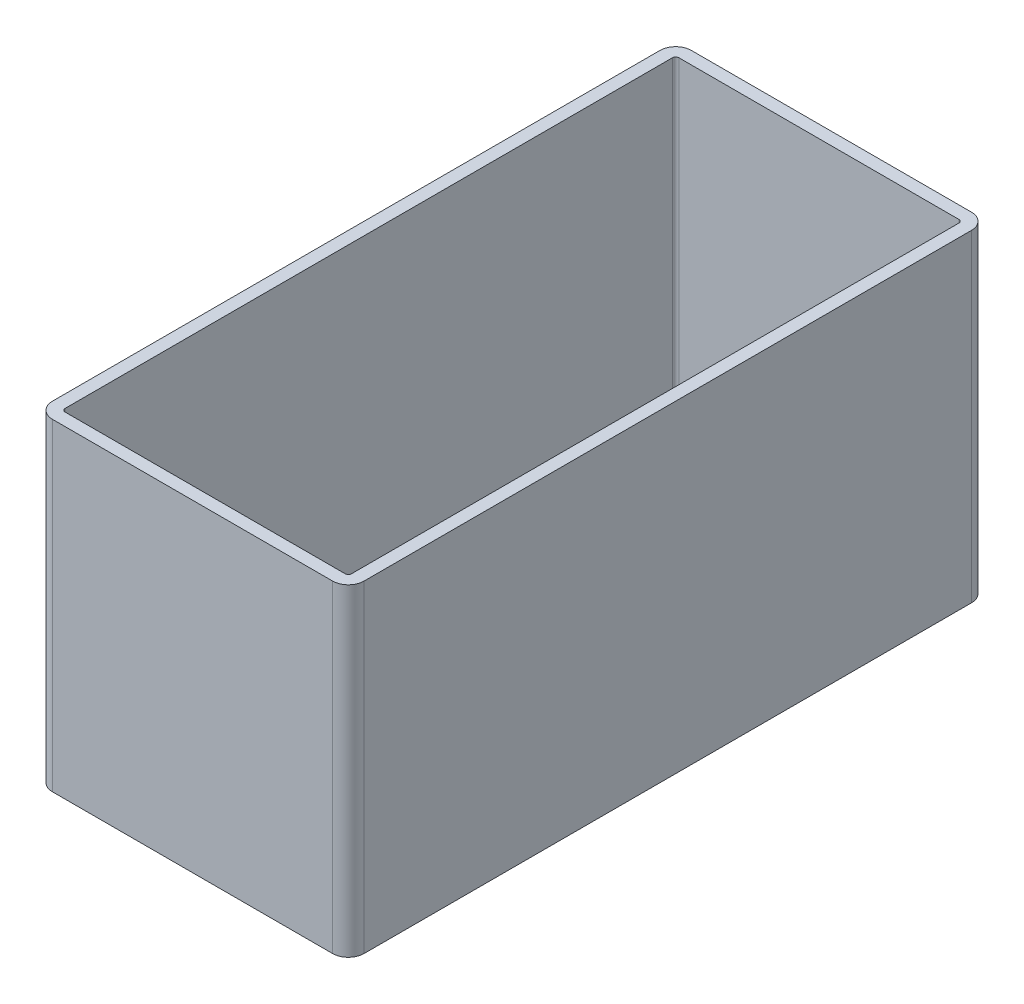
ISO-10303-21;
HEADER;
FILE_DESCRIPTION(('STEP AP214'),'2;1');
FILE_NAME('part.step','',(''),(''),'','','');
FILE_SCHEMA(('AUTOMOTIVE_DESIGN { 1 0 10303 214 1 1 1 1 }'));
ENDSEC;
DATA;
#1=APPLICATION_CONTEXT('core data for automotive mechanical design processes');
#2=APPLICATION_PROTOCOL_DEFINITION('international standard','automotive_design',2000,#1);
#3=PRODUCT_CONTEXT('',#1,'mechanical');
#4=PRODUCT('Part','Part','',(#3));
#5=PRODUCT_RELATED_PRODUCT_CATEGORY('part','',(#4));
#6=PRODUCT_DEFINITION_FORMATION('','',#4);
#7=PRODUCT_DEFINITION_CONTEXT('part definition',#1,'design');
#8=PRODUCT_DEFINITION('design','',#6,#7);
#9=PRODUCT_DEFINITION_SHAPE('','',#8);
#10=(LENGTH_UNIT() NAMED_UNIT(*) SI_UNIT(.MILLI.,.METRE.));
#11=(NAMED_UNIT(*) PLANE_ANGLE_UNIT() SI_UNIT($,.RADIAN.));
#12=(NAMED_UNIT(*) SI_UNIT($,.STERADIAN.) SOLID_ANGLE_UNIT());
#13=UNCERTAINTY_MEASURE_WITH_UNIT(LENGTH_MEASURE(1.E-05),#10,'distance_accuracy_value','');
#14=(GEOMETRIC_REPRESENTATION_CONTEXT(3) GLOBAL_UNCERTAINTY_ASSIGNED_CONTEXT((#13)) GLOBAL_UNIT_ASSIGNED_CONTEXT((#10,
#11,#12)) REPRESENTATION_CONTEXT('',''));
#15=CARTESIAN_POINT('',(0.,0.,0.));
#16=DIRECTION('',(0.,0.,1.));
#17=DIRECTION('',(1.,0.,0.));
#18=AXIS2_PLACEMENT_3D('',#15,#16,#17);
#19=CARTESIAN_POINT('',(9.9,10.25,-20.3));
#20=DIRECTION('',(-1.,0.,0.));
#21=DIRECTION('',(0.,0.,1.));
#22=AXIS2_PLACEMENT_3D('',#19,#20,#21);
#23=PLANE('',#22);
#24=DIRECTION('',(0.,0.,-1.));
#25=VECTOR('',#24,1.);
#26=CARTESIAN_POINT('',(9.9,-10.25,-20.3));
#27=LINE('',#26,#25);
#28=CARTESIAN_POINT('',(9.9,-10.25,19.3));
#29=VERTEX_POINT('',#28);
#30=CARTESIAN_POINT('',(9.9,-10.25,-19.3));
#31=VERTEX_POINT('',#30);
#32=EDGE_CURVE('E201',#29,#31,#27,.T.);
#33=ORIENTED_EDGE('',*,*,#32,.T.);
#34=DIRECTION('',(0.,-1.,0.));
#35=VECTOR('',#34,1.);
#36=CARTESIAN_POINT('',(9.9,10.25,-19.3));
#37=LINE('',#36,#35);
#38=CARTESIAN_POINT('',(9.9,10.25,-19.3));
#39=VERTEX_POINT('',#38);
#40=EDGE_CURVE('E265',#31,#39,#37,.F.);
#41=ORIENTED_EDGE('',*,*,#40,.T.);
#42=DIRECTION('',(0.,0.,-1.));
#43=VECTOR('',#42,1.);
#44=CARTESIAN_POINT('',(9.9,10.25,-20.3));
#45=LINE('',#44,#43);
#46=CARTESIAN_POINT('',(9.9,10.25,19.3));
#47=VERTEX_POINT('',#46);
#48=EDGE_CURVE('E213',#47,#39,#45,.T.);
#49=ORIENTED_EDGE('',*,*,#48,.F.);
#50=DIRECTION('',(0.,-1.,0.));
#51=VECTOR('',#50,1.);
#52=CARTESIAN_POINT('',(9.9,10.25,19.3));
#53=LINE('',#52,#51);
#54=EDGE_CURVE('E262',#47,#29,#53,.T.);
#55=ORIENTED_EDGE('',*,*,#54,.T.);
#56=EDGE_LOOP('',(#33,#41,#49,#55));
#57=FACE_BOUND('',#56,.T.);
#58=ADVANCED_FACE('F32',(#57),#23,.F.);
#59=CARTESIAN_POINT('',(-9.9,10.25,-20.3));
#60=DIRECTION('',(0.,0.,1.));
#61=DIRECTION('',(1.,0.,0.));
#62=AXIS2_PLACEMENT_3D('',#59,#60,#61);
#63=PLANE('',#62);
#64=DIRECTION('',(-1.,0.,0.));
#65=VECTOR('',#64,1.);
#66=CARTESIAN_POINT('',(-9.9,-10.25,-20.3));
#67=LINE('',#66,#65);
#68=CARTESIAN_POINT('',(8.89999999999999,-10.25,-20.3));
#69=VERTEX_POINT('',#68);
#70=CARTESIAN_POINT('',(-8.9,-10.25,-20.3));
#71=VERTEX_POINT('',#70);
#72=EDGE_CURVE('E229',#69,#71,#67,.T.);
#73=ORIENTED_EDGE('',*,*,#72,.T.);
#74=DIRECTION('',(0.,-1.,0.));
#75=VECTOR('',#74,1.);
#76=CARTESIAN_POINT('',(-8.9,10.25,-20.3));
#77=LINE('',#76,#75);
#78=CARTESIAN_POINT('',(-8.9,10.25,-20.3));
#79=VERTEX_POINT('',#78);
#80=EDGE_CURVE('E252',#71,#79,#77,.F.);
#81=ORIENTED_EDGE('',*,*,#80,.T.);
#82=DIRECTION('',(-1.,0.,0.));
#83=VECTOR('',#82,1.);
#84=CARTESIAN_POINT('',(-9.9,10.25,-20.3));
#85=LINE('',#84,#83);
#86=CARTESIAN_POINT('',(8.89999999999999,10.25,-20.3));
#87=VERTEX_POINT('',#86);
#88=EDGE_CURVE('E216',#87,#79,#85,.T.);
#89=ORIENTED_EDGE('',*,*,#88,.F.);
#90=DIRECTION('',(0.,-1.,0.));
#91=VECTOR('',#90,1.);
#92=CARTESIAN_POINT('',(8.9,10.25,-20.3));
#93=LINE('',#92,#91);
#94=EDGE_CURVE('E249',#87,#69,#93,.T.);
#95=ORIENTED_EDGE('',*,*,#94,.T.);
#96=EDGE_LOOP('',(#73,#81,#89,#95));
#97=FACE_BOUND('',#96,.T.);
#98=ADVANCED_FACE('F293',(#97),#63,.F.);
#99=CARTESIAN_POINT('',(-9.9,10.25,-20.3));
#100=DIRECTION('',(1.,0.,0.));
#101=DIRECTION('',(0.,0.,-1.));
#102=AXIS2_PLACEMENT_3D('',#99,#100,#101);
#103=PLANE('',#102);
#104=DIRECTION('',(0.,0.,1.));
#105=VECTOR('',#104,1.);
#106=CARTESIAN_POINT('',(-9.9,10.25,-20.3));
#107=LINE('',#106,#105);
#108=CARTESIAN_POINT('',(-9.9,10.25,-19.3));
#109=VERTEX_POINT('',#108);
#110=CARTESIAN_POINT('',(-9.9,10.25,19.3));
#111=VERTEX_POINT('',#110);
#112=EDGE_CURVE('E220',#109,#111,#107,.T.);
#113=ORIENTED_EDGE('',*,*,#112,.F.);
#114=DIRECTION('',(0.,-1.,0.));
#115=VECTOR('',#114,1.);
#116=CARTESIAN_POINT('',(-9.9,10.25,-19.3));
#117=LINE('',#116,#115);
#118=CARTESIAN_POINT('',(-9.9,-10.25,-19.3));
#119=VERTEX_POINT('',#118);
#120=EDGE_CURVE('E238',#109,#119,#117,.T.);
#121=ORIENTED_EDGE('',*,*,#120,.T.);
#122=DIRECTION('',(0.,0.,1.));
#123=VECTOR('',#122,1.);
#124=CARTESIAN_POINT('',(-9.9,-10.25,-20.3));
#125=LINE('',#124,#123);
#126=CARTESIAN_POINT('',(-9.9,-10.25,19.3));
#127=VERTEX_POINT('',#126);
#128=EDGE_CURVE('E232',#119,#127,#125,.T.);
#129=ORIENTED_EDGE('',*,*,#128,.T.);
#130=DIRECTION('',(0.,-1.,0.));
#131=VECTOR('',#130,1.);
#132=CARTESIAN_POINT('',(-9.9,10.25,19.3));
#133=LINE('',#132,#131);
#134=EDGE_CURVE('E226',#127,#111,#133,.F.);
#135=ORIENTED_EDGE('',*,*,#134,.T.);
#136=EDGE_LOOP('',(#113,#121,#129,#135));
#137=FACE_BOUND('',#136,.T.);
#138=ADVANCED_FACE('F301',(#137),#103,.F.);
#139=CARTESIAN_POINT('',(-9.9,10.25,20.3));
#140=DIRECTION('',(0.,0.,-1.));
#141=DIRECTION('',(-1.,0.,0.));
#142=AXIS2_PLACEMENT_3D('',#139,#140,#141);
#143=PLANE('',#142);
#144=DIRECTION('',(1.,0.,0.));
#145=VECTOR('',#144,1.);
#146=CARTESIAN_POINT('',(-9.9,-10.25,20.3));
#147=LINE('',#146,#145);
#148=CARTESIAN_POINT('',(-8.9,-10.25,20.3));
#149=VERTEX_POINT('',#148);
#150=CARTESIAN_POINT('',(8.9,-10.25,20.3));
#151=VERTEX_POINT('',#150);
#152=EDGE_CURVE('E217',#149,#151,#147,.T.);
#153=ORIENTED_EDGE('',*,*,#152,.T.);
#154=DIRECTION('',(0.,-1.,0.));
#155=VECTOR('',#154,1.);
#156=CARTESIAN_POINT('',(8.9,10.25,20.3));
#157=LINE('',#156,#155);
#158=CARTESIAN_POINT('',(8.9,10.25,20.3));
#159=VERTEX_POINT('',#158);
#160=EDGE_CURVE('E11',#151,#159,#157,.F.);
#161=ORIENTED_EDGE('',*,*,#160,.T.);
#162=DIRECTION('',(1.,0.,0.));
#163=VECTOR('',#162,1.);
#164=CARTESIAN_POINT('',(-9.9,10.25,20.3));
#165=LINE('',#164,#163);
#166=CARTESIAN_POINT('',(-8.9,10.25,20.3));
#167=VERTEX_POINT('',#166);
#168=EDGE_CURVE('E223',#167,#159,#165,.T.);
#169=ORIENTED_EDGE('',*,*,#168,.F.);
#170=DIRECTION('',(0.,-1.,0.));
#171=VECTOR('',#170,1.);
#172=CARTESIAN_POINT('',(-8.9,10.25,20.3));
#173=LINE('',#172,#171);
#174=EDGE_CURVE('E40',#167,#149,#173,.T.);
#175=ORIENTED_EDGE('',*,*,#174,.T.);
#176=EDGE_LOOP('',(#153,#161,#169,#175));
#177=FACE_BOUND('',#176,.T.);
#178=ADVANCED_FACE('F271',(#177),#143,.F.);
#179=CARTESIAN_POINT('',(0.,10.25,0.));
#180=DIRECTION('',(0.,1.,0.));
#181=DIRECTION('',(0.,0.,1.));
#182=AXIS2_PLACEMENT_3D('',#179,#180,#181);
#183=PLANE('',#182);
#184=CARTESIAN_POINT('',(8.9,10.25,-19.3));
#185=DIRECTION('',(0.,1.,0.));
#186=DIRECTION('',(0.,0.,1.));
#187=AXIS2_PLACEMENT_3D('',#184,#185,#186);
#188=CIRCLE('',#187,0.200000000000003);
#189=CARTESIAN_POINT('',(9.1,10.25,-19.3));
#190=VERTEX_POINT('',#189);
#191=CARTESIAN_POINT('',(8.89999999999999,10.25,-19.5));
#192=VERTEX_POINT('',#191);
#193=EDGE_CURVE('E47',#190,#192,#188,.T.);
#194=ORIENTED_EDGE('',*,*,#193,.F.);
#195=DIRECTION('',(0.,0.,-1.));
#196=VECTOR('',#195,1.);
#197=CARTESIAN_POINT('',(9.1,10.25,19.3));
#198=LINE('',#197,#196);
#199=CARTESIAN_POINT('',(9.1,10.25,19.3));
#200=VERTEX_POINT('',#199);
#201=EDGE_CURVE('E163',#200,#190,#198,.T.);
#202=ORIENTED_EDGE('',*,*,#201,.F.);
#203=CARTESIAN_POINT('',(8.9,10.25,19.3));
#204=DIRECTION('',(0.,1.,0.));
#205=DIRECTION('',(0.,0.,1.));
#206=AXIS2_PLACEMENT_3D('',#203,#204,#205);
#207=CIRCLE('',#206,0.200000000000001);
#208=CARTESIAN_POINT('',(8.9,10.25,19.5));
#209=VERTEX_POINT('',#208);
#210=EDGE_CURVE('E166',#209,#200,#207,.T.);
#211=ORIENTED_EDGE('',*,*,#210,.F.);
#212=DIRECTION('',(1.,0.,0.));
#213=VECTOR('',#212,1.);
#214=CARTESIAN_POINT('',(-8.9,10.25,19.5));
#215=LINE('',#214,#213);
#216=CARTESIAN_POINT('',(-8.9,10.25,19.5));
#217=VERTEX_POINT('',#216);
#218=EDGE_CURVE('E194',#217,#209,#215,.T.);
#219=ORIENTED_EDGE('',*,*,#218,.F.);
#220=CARTESIAN_POINT('',(-8.9,10.25,19.3));
#221=DIRECTION('',(0.,1.,0.));
#222=DIRECTION('',(0.,0.,1.));
#223=AXIS2_PLACEMENT_3D('',#220,#221,#222);
#224=CIRCLE('',#223,0.200000000000005);
#225=CARTESIAN_POINT('',(-9.1,10.25,19.3));
#226=VERTEX_POINT('',#225);
#227=EDGE_CURVE('E191',#226,#217,#224,.T.);
#228=ORIENTED_EDGE('',*,*,#227,.F.);
#229=DIRECTION('',(0.,0.,1.));
#230=VECTOR('',#229,1.);
#231=CARTESIAN_POINT('',(-9.1,10.25,-19.3));
#232=LINE('',#231,#230);
#233=CARTESIAN_POINT('',(-9.1,10.25,-19.3));
#234=VERTEX_POINT('',#233);
#235=EDGE_CURVE('E188',#234,#226,#232,.T.);
#236=ORIENTED_EDGE('',*,*,#235,.F.);
#237=CARTESIAN_POINT('',(-8.9,10.25,-19.3));
#238=DIRECTION('',(0.,1.,0.));
#239=DIRECTION('',(0.,0.,1.));
#240=AXIS2_PLACEMENT_3D('',#237,#238,#239);
#241=CIRCLE('',#240,0.200000000000001);
#242=CARTESIAN_POINT('',(-8.9,10.25,-19.5));
#243=VERTEX_POINT('',#242);
#244=EDGE_CURVE('E185',#243,#234,#241,.T.);
#245=ORIENTED_EDGE('',*,*,#244,.F.);
#246=DIRECTION('',(-1.,0.,0.));
#247=VECTOR('',#246,1.);
#248=CARTESIAN_POINT('',(8.89999999999999,10.25,-19.5));
#249=LINE('',#248,#247);
#250=EDGE_CURVE('E183',#192,#243,#249,.T.);
#251=ORIENTED_EDGE('',*,*,#250,.F.);
#252=EDGE_LOOP('',(#194,#202,#211,#219,#228,#236,#245,#251));
#253=FACE_BOUND('',#252,.T.);
#254=ORIENTED_EDGE('',*,*,#88,.T.);
#255=CARTESIAN_POINT('',(-8.9,10.25,-19.3));
#256=DIRECTION('',(0.,1.,0.));
#257=DIRECTION('',(0.,0.,1.));
#258=AXIS2_PLACEMENT_3D('',#255,#256,#257);
#259=CIRCLE('',#258,1.);
#260=EDGE_CURVE('E260',#79,#109,#259,.T.);
#261=ORIENTED_EDGE('',*,*,#260,.T.);
#262=ORIENTED_EDGE('',*,*,#112,.T.);
#263=CARTESIAN_POINT('',(-8.9,10.25,19.3));
#264=DIRECTION('',(0.,1.,0.));
#265=DIRECTION('',(0.,0.,1.));
#266=AXIS2_PLACEMENT_3D('',#263,#264,#265);
#267=CIRCLE('',#266,1.);
#268=EDGE_CURVE('E254',#111,#167,#267,.T.);
#269=ORIENTED_EDGE('',*,*,#268,.T.);
#270=ORIENTED_EDGE('',*,*,#168,.T.);
#271=CARTESIAN_POINT('',(8.9,10.25,19.3));
#272=DIRECTION('',(0.,1.,0.));
#273=DIRECTION('',(0.,0.,1.));
#274=AXIS2_PLACEMENT_3D('',#271,#272,#273);
#275=CIRCLE('',#274,1.);
#276=EDGE_CURVE('E256',#159,#47,#275,.T.);
#277=ORIENTED_EDGE('',*,*,#276,.T.);
#278=ORIENTED_EDGE('',*,*,#48,.T.);
#279=CARTESIAN_POINT('',(8.9,10.25,-19.3));
#280=DIRECTION('',(0.,1.,0.));
#281=DIRECTION('',(0.,0.,1.));
#282=AXIS2_PLACEMENT_3D('',#279,#280,#281);
#283=CIRCLE('',#282,1.);
#284=EDGE_CURVE('E258',#39,#87,#283,.T.);
#285=ORIENTED_EDGE('',*,*,#284,.T.);
#286=EDGE_LOOP('',(#254,#261,#262,#269,#270,#277,#278,#285));
#287=FACE_BOUND('',#286,.T.);
#288=ADVANCED_FACE('F286',(#253,#287),#183,.T.);
#289=CARTESIAN_POINT('',(0.,-10.25,0.));
#290=DIRECTION('',(0.,1.,0.));
#291=DIRECTION('',(0.,0.,1.));
#292=AXIS2_PLACEMENT_3D('',#289,#290,#291);
#293=PLANE('',#292);
#294=DIRECTION('',(0.,0.,-1.));
#295=VECTOR('',#294,1.);
#296=CARTESIAN_POINT('',(9.1,-10.25,19.3));
#297=LINE('',#296,#295);
#298=CARTESIAN_POINT('',(9.1,-10.25,19.3));
#299=VERTEX_POINT('',#298);
#300=CARTESIAN_POINT('',(9.1,-10.25,-19.3));
#301=VERTEX_POINT('',#300);
#302=EDGE_CURVE('E152',#299,#301,#297,.T.);
#303=ORIENTED_EDGE('',*,*,#302,.T.);
#304=CARTESIAN_POINT('',(8.9,-10.25,-19.3));
#305=DIRECTION('',(0.,1.,0.));
#306=DIRECTION('',(0.,0.,1.));
#307=AXIS2_PLACEMENT_3D('',#304,#305,#306);
#308=CIRCLE('',#307,0.200000000000003);
#309=CARTESIAN_POINT('',(8.89999999999999,-10.25,-19.5));
#310=VERTEX_POINT('',#309);
#311=EDGE_CURVE('E146',#301,#310,#308,.T.);
#312=ORIENTED_EDGE('',*,*,#311,.T.);
#313=DIRECTION('',(-1.,0.,0.));
#314=VECTOR('',#313,1.);
#315=CARTESIAN_POINT('',(8.89999999999999,-10.25,-19.5));
#316=LINE('',#315,#314);
#317=CARTESIAN_POINT('',(-8.9,-10.25,-19.5));
#318=VERTEX_POINT('',#317);
#319=EDGE_CURVE('E155',#310,#318,#316,.T.);
#320=ORIENTED_EDGE('',*,*,#319,.T.);
#321=CARTESIAN_POINT('',(-8.9,-10.25,-19.3));
#322=DIRECTION('',(0.,1.,0.));
#323=DIRECTION('',(0.,0.,1.));
#324=AXIS2_PLACEMENT_3D('',#321,#322,#323);
#325=CIRCLE('',#324,0.200000000000001);
#326=CARTESIAN_POINT('',(-9.1,-10.25,-19.3));
#327=VERTEX_POINT('',#326);
#328=EDGE_CURVE('E55',#318,#327,#325,.T.);
#329=ORIENTED_EDGE('',*,*,#328,.T.);
#330=DIRECTION('',(0.,0.,1.));
#331=VECTOR('',#330,1.);
#332=CARTESIAN_POINT('',(-9.1,-10.25,-19.3));
#333=LINE('',#332,#331);
#334=CARTESIAN_POINT('',(-9.1,-10.25,19.3));
#335=VERTEX_POINT('',#334);
#336=EDGE_CURVE('E170',#327,#335,#333,.T.);
#337=ORIENTED_EDGE('',*,*,#336,.T.);
#338=CARTESIAN_POINT('',(-8.9,-10.25,19.3));
#339=DIRECTION('',(0.,1.,0.));
#340=DIRECTION('',(0.,0.,1.));
#341=AXIS2_PLACEMENT_3D('',#338,#339,#340);
#342=CIRCLE('',#341,0.200000000000005);
#343=CARTESIAN_POINT('',(-8.9,-10.25,19.5));
#344=VERTEX_POINT('',#343);
#345=EDGE_CURVE('E173',#335,#344,#342,.T.);
#346=ORIENTED_EDGE('',*,*,#345,.T.);
#347=DIRECTION('',(1.,0.,0.));
#348=VECTOR('',#347,1.);
#349=CARTESIAN_POINT('',(-8.9,-10.25,19.5));
#350=LINE('',#349,#348);
#351=CARTESIAN_POINT('',(8.9,-10.25,19.5));
#352=VERTEX_POINT('',#351);
#353=EDGE_CURVE('E176',#344,#352,#350,.T.);
#354=ORIENTED_EDGE('',*,*,#353,.T.);
#355=CARTESIAN_POINT('',(8.9,-10.25,19.3));
#356=DIRECTION('',(0.,1.,0.));
#357=DIRECTION('',(0.,0.,1.));
#358=AXIS2_PLACEMENT_3D('',#355,#356,#357);
#359=CIRCLE('',#358,0.200000000000001);
#360=EDGE_CURVE('E179',#352,#299,#359,.T.);
#361=ORIENTED_EDGE('',*,*,#360,.T.);
#362=EDGE_LOOP('',(#303,#312,#320,#329,#337,#346,#354,#361));
#363=FACE_BOUND('',#362,.T.);
#364=ORIENTED_EDGE('',*,*,#128,.F.);
#365=CARTESIAN_POINT('',(-8.9,-10.25,-19.3));
#366=DIRECTION('',(0.,1.,0.));
#367=DIRECTION('',(0.,0.,1.));
#368=AXIS2_PLACEMENT_3D('',#365,#366,#367);
#369=CIRCLE('',#368,1.);
#370=EDGE_CURVE('E247',#119,#71,#369,.F.);
#371=ORIENTED_EDGE('',*,*,#370,.T.);
#372=ORIENTED_EDGE('',*,*,#72,.F.);
#373=CARTESIAN_POINT('',(8.9,-10.25,-19.3));
#374=DIRECTION('',(0.,1.,0.));
#375=DIRECTION('',(0.,0.,1.));
#376=AXIS2_PLACEMENT_3D('',#373,#374,#375);
#377=CIRCLE('',#376,1.);
#378=EDGE_CURVE('E245',#69,#31,#377,.F.);
#379=ORIENTED_EDGE('',*,*,#378,.T.);
#380=ORIENTED_EDGE('',*,*,#32,.F.);
#381=CARTESIAN_POINT('',(8.9,-10.25,19.3));
#382=DIRECTION('',(0.,1.,0.));
#383=DIRECTION('',(0.,0.,1.));
#384=AXIS2_PLACEMENT_3D('',#381,#382,#383);
#385=CIRCLE('',#384,1.);
#386=EDGE_CURVE('E243',#29,#151,#385,.F.);
#387=ORIENTED_EDGE('',*,*,#386,.T.);
#388=ORIENTED_EDGE('',*,*,#152,.F.);
#389=CARTESIAN_POINT('',(-8.9,-10.25,19.3));
#390=DIRECTION('',(0.,1.,0.));
#391=DIRECTION('',(0.,0.,1.));
#392=AXIS2_PLACEMENT_3D('',#389,#390,#391);
#393=CIRCLE('',#392,1.);
#394=EDGE_CURVE('E241',#149,#127,#393,.F.);
#395=ORIENTED_EDGE('',*,*,#394,.T.);
#396=EDGE_LOOP('',(#364,#371,#372,#379,#380,#387,#388,#395));
#397=FACE_BOUND('',#396,.T.);
#398=ADVANCED_FACE('F159',(#363,#397),#293,.F.);
#399=CARTESIAN_POINT('',(-8.9,10.25,-19.3));
#400=DIRECTION('',(0.,-1.,0.));
#401=DIRECTION('',(0.,0.,-1.));
#402=AXIS2_PLACEMENT_3D('',#399,#400,#401);
#403=CYLINDRICAL_SURFACE('',#402,1.);
#404=ORIENTED_EDGE('',*,*,#260,.F.);
#405=ORIENTED_EDGE('',*,*,#80,.F.);
#406=ORIENTED_EDGE('',*,*,#370,.F.);
#407=ORIENTED_EDGE('',*,*,#120,.F.);
#408=EDGE_LOOP('',(#404,#405,#406,#407));
#409=FACE_BOUND('',#408,.T.);
#410=ADVANCED_FACE('F298',(#409),#403,.T.);
#411=CARTESIAN_POINT('',(8.9,10.25,-19.3));
#412=DIRECTION('',(0.,-1.,0.));
#413=DIRECTION('',(0.,0.,-1.));
#414=AXIS2_PLACEMENT_3D('',#411,#412,#413);
#415=CYLINDRICAL_SURFACE('',#414,1.);
#416=ORIENTED_EDGE('',*,*,#284,.F.);
#417=ORIENTED_EDGE('',*,*,#40,.F.);
#418=ORIENTED_EDGE('',*,*,#378,.F.);
#419=ORIENTED_EDGE('',*,*,#94,.F.);
#420=EDGE_LOOP('',(#416,#417,#418,#419));
#421=FACE_BOUND('',#420,.T.);
#422=ADVANCED_FACE('F290',(#421),#415,.T.);
#423=CARTESIAN_POINT('',(8.9,10.25,19.3));
#424=DIRECTION('',(0.,-1.,0.));
#425=DIRECTION('',(0.,0.,-1.));
#426=AXIS2_PLACEMENT_3D('',#423,#424,#425);
#427=CYLINDRICAL_SURFACE('',#426,1.);
#428=ORIENTED_EDGE('',*,*,#276,.F.);
#429=ORIENTED_EDGE('',*,*,#160,.F.);
#430=ORIENTED_EDGE('',*,*,#386,.F.);
#431=ORIENTED_EDGE('',*,*,#54,.F.);
#432=EDGE_LOOP('',(#428,#429,#430,#431));
#433=FACE_BOUND('',#432,.T.);
#434=ADVANCED_FACE('F280',(#433),#427,.T.);
#435=CARTESIAN_POINT('',(-8.9,10.25,19.3));
#436=DIRECTION('',(0.,-1.,0.));
#437=DIRECTION('',(0.,0.,-1.));
#438=AXIS2_PLACEMENT_3D('',#435,#436,#437);
#439=CYLINDRICAL_SURFACE('',#438,1.);
#440=ORIENTED_EDGE('',*,*,#268,.F.);
#441=ORIENTED_EDGE('',*,*,#134,.F.);
#442=ORIENTED_EDGE('',*,*,#394,.F.);
#443=ORIENTED_EDGE('',*,*,#174,.F.);
#444=EDGE_LOOP('',(#440,#441,#442,#443));
#445=FACE_BOUND('',#444,.T.);
#446=ADVANCED_FACE('F34',(#445),#439,.T.);
#447=CARTESIAN_POINT('',(8.9,-10.25,-19.3));
#448=DIRECTION('',(0.,1.,0.));
#449=DIRECTION('',(0.,0.,1.));
#450=AXIS2_PLACEMENT_3D('',#447,#448,#449);
#451=CYLINDRICAL_SURFACE('',#450,0.200000000000003);
#452=ORIENTED_EDGE('',*,*,#193,.T.);
#453=DIRECTION('',(0.,1.,0.));
#454=VECTOR('',#453,1.);
#455=CARTESIAN_POINT('',(8.89999999999999,-10.25,-19.5));
#456=LINE('',#455,#454);
#457=EDGE_CURVE('E142',#310,#192,#456,.T.);
#458=ORIENTED_EDGE('',*,*,#457,.F.);
#459=ORIENTED_EDGE('',*,*,#311,.F.);
#460=DIRECTION('',(0.,1.,0.));
#461=VECTOR('',#460,1.);
#462=CARTESIAN_POINT('',(9.1,-10.25,-19.3));
#463=LINE('',#462,#461);
#464=EDGE_CURVE('E199',#301,#190,#463,.T.);
#465=ORIENTED_EDGE('',*,*,#464,.T.);
#466=EDGE_LOOP('',(#452,#458,#459,#465));
#467=FACE_BOUND('',#466,.T.);
#468=ADVANCED_FACE('F144',(#467),#451,.F.);
#469=CARTESIAN_POINT('',(9.1,-10.25,19.3));
#470=DIRECTION('',(1.,0.,0.));
#471=DIRECTION('',(0.,0.,-1.));
#472=AXIS2_PLACEMENT_3D('',#469,#470,#471);
#473=PLANE('',#472);
#474=ORIENTED_EDGE('',*,*,#201,.T.);
#475=ORIENTED_EDGE('',*,*,#464,.F.);
#476=ORIENTED_EDGE('',*,*,#302,.F.);
#477=DIRECTION('',(0.,1.,0.));
#478=VECTOR('',#477,1.);
#479=CARTESIAN_POINT('',(9.1,-10.25,19.3));
#480=LINE('',#479,#478);
#481=EDGE_CURVE('E202',#299,#200,#480,.T.);
#482=ORIENTED_EDGE('',*,*,#481,.T.);
#483=EDGE_LOOP('',(#474,#475,#476,#482));
#484=FACE_BOUND('',#483,.T.);
#485=ADVANCED_FACE('F308',(#484),#473,.F.);
#486=CARTESIAN_POINT('',(8.9,-10.25,19.3));
#487=DIRECTION('',(0.,1.,0.));
#488=DIRECTION('',(0.,0.,1.));
#489=AXIS2_PLACEMENT_3D('',#486,#487,#488);
#490=CYLINDRICAL_SURFACE('',#489,0.200000000000001);
#491=ORIENTED_EDGE('',*,*,#210,.T.);
#492=ORIENTED_EDGE('',*,*,#481,.F.);
#493=ORIENTED_EDGE('',*,*,#360,.F.);
#494=DIRECTION('',(0.,1.,0.));
#495=VECTOR('',#494,1.);
#496=CARTESIAN_POINT('',(8.9,-10.25,19.5));
#497=LINE('',#496,#495);
#498=EDGE_CURVE('E204',#352,#209,#497,.T.);
#499=ORIENTED_EDGE('',*,*,#498,.T.);
#500=EDGE_LOOP('',(#491,#492,#493,#499));
#501=FACE_BOUND('',#500,.T.);
#502=ADVANCED_FACE('F368',(#501),#490,.F.);
#503=CARTESIAN_POINT('',(-8.9,-10.25,19.5));
#504=DIRECTION('',(0.,0.,1.));
#505=DIRECTION('',(1.,0.,0.));
#506=AXIS2_PLACEMENT_3D('',#503,#504,#505);
#507=PLANE('',#506);
#508=ORIENTED_EDGE('',*,*,#218,.T.);
#509=ORIENTED_EDGE('',*,*,#498,.F.);
#510=ORIENTED_EDGE('',*,*,#353,.F.);
#511=DIRECTION('',(0.,1.,0.));
#512=VECTOR('',#511,1.);
#513=CARTESIAN_POINT('',(-8.9,-10.25,19.5));
#514=LINE('',#513,#512);
#515=EDGE_CURVE('E206',#344,#217,#514,.T.);
#516=ORIENTED_EDGE('',*,*,#515,.T.);
#517=EDGE_LOOP('',(#508,#509,#510,#516));
#518=FACE_BOUND('',#517,.T.);
#519=ADVANCED_FACE('F378',(#518),#507,.F.);
#520=CARTESIAN_POINT('',(-8.9,-10.25,19.3));
#521=DIRECTION('',(0.,1.,0.));
#522=DIRECTION('',(0.,0.,1.));
#523=AXIS2_PLACEMENT_3D('',#520,#521,#522);
#524=CYLINDRICAL_SURFACE('',#523,0.200000000000005);
#525=ORIENTED_EDGE('',*,*,#227,.T.);
#526=ORIENTED_EDGE('',*,*,#515,.F.);
#527=ORIENTED_EDGE('',*,*,#345,.F.);
#528=DIRECTION('',(0.,1.,0.));
#529=VECTOR('',#528,1.);
#530=CARTESIAN_POINT('',(-9.1,-10.25,19.3));
#531=LINE('',#530,#529);
#532=EDGE_CURVE('E208',#335,#226,#531,.T.);
#533=ORIENTED_EDGE('',*,*,#532,.T.);
#534=EDGE_LOOP('',(#525,#526,#527,#533));
#535=FACE_BOUND('',#534,.T.);
#536=ADVANCED_FACE('F388',(#535),#524,.F.);
#537=CARTESIAN_POINT('',(-9.1,-10.25,-19.3));
#538=DIRECTION('',(-1.,0.,0.));
#539=DIRECTION('',(0.,0.,1.));
#540=AXIS2_PLACEMENT_3D('',#537,#538,#539);
#541=PLANE('',#540);
#542=ORIENTED_EDGE('',*,*,#235,.T.);
#543=ORIENTED_EDGE('',*,*,#532,.F.);
#544=ORIENTED_EDGE('',*,*,#336,.F.);
#545=DIRECTION('',(0.,1.,0.));
#546=VECTOR('',#545,1.);
#547=CARTESIAN_POINT('',(-9.1,-10.25,-19.3));
#548=LINE('',#547,#546);
#549=EDGE_CURVE('E210',#327,#234,#548,.T.);
#550=ORIENTED_EDGE('',*,*,#549,.T.);
#551=EDGE_LOOP('',(#542,#543,#544,#550));
#552=FACE_BOUND('',#551,.T.);
#553=ADVANCED_FACE('F398',(#552),#541,.F.);
#554=CARTESIAN_POINT('',(-8.9,-10.25,-19.3));
#555=DIRECTION('',(0.,1.,0.));
#556=DIRECTION('',(0.,0.,1.));
#557=AXIS2_PLACEMENT_3D('',#554,#555,#556);
#558=CYLINDRICAL_SURFACE('',#557,0.200000000000001);
#559=ORIENTED_EDGE('',*,*,#244,.T.);
#560=ORIENTED_EDGE('',*,*,#549,.F.);
#561=ORIENTED_EDGE('',*,*,#328,.F.);
#562=DIRECTION('',(0.,1.,0.));
#563=VECTOR('',#562,1.);
#564=CARTESIAN_POINT('',(-8.9,-10.25,-19.5));
#565=LINE('',#564,#563);
#566=EDGE_CURVE('E151',#318,#243,#565,.T.);
#567=ORIENTED_EDGE('',*,*,#566,.T.);
#568=EDGE_LOOP('',(#559,#560,#561,#567));
#569=FACE_BOUND('',#568,.T.);
#570=ADVANCED_FACE('F408',(#569),#558,.F.);
#571=CARTESIAN_POINT('',(8.89999999999999,-10.25,-19.5));
#572=DIRECTION('',(0.,0.,-1.));
#573=DIRECTION('',(-1.,0.,0.));
#574=AXIS2_PLACEMENT_3D('',#571,#572,#573);
#575=PLANE('',#574);
#576=ORIENTED_EDGE('',*,*,#250,.T.);
#577=ORIENTED_EDGE('',*,*,#566,.F.);
#578=ORIENTED_EDGE('',*,*,#319,.F.);
#579=ORIENTED_EDGE('',*,*,#457,.T.);
#580=EDGE_LOOP('',(#576,#577,#578,#579));
#581=FACE_BOUND('',#580,.T.);
#582=ADVANCED_FACE('F156',(#581),#575,.F.);
#583=CLOSED_SHELL('',(#58,#98,#138,#178,#288,#398,#410,#422,#434,#446,#468,#485,#502,#519,#536,
#553,#570,#582));
#584=MANIFOLD_SOLID_BREP('B2',#583);
#585=ADVANCED_BREP_SHAPE_REPRESENTATION('',(#18,#584),#14);
#586=SHAPE_DEFINITION_REPRESENTATION(#9,#585);
ENDSEC;
END-ISO-10303-21;
